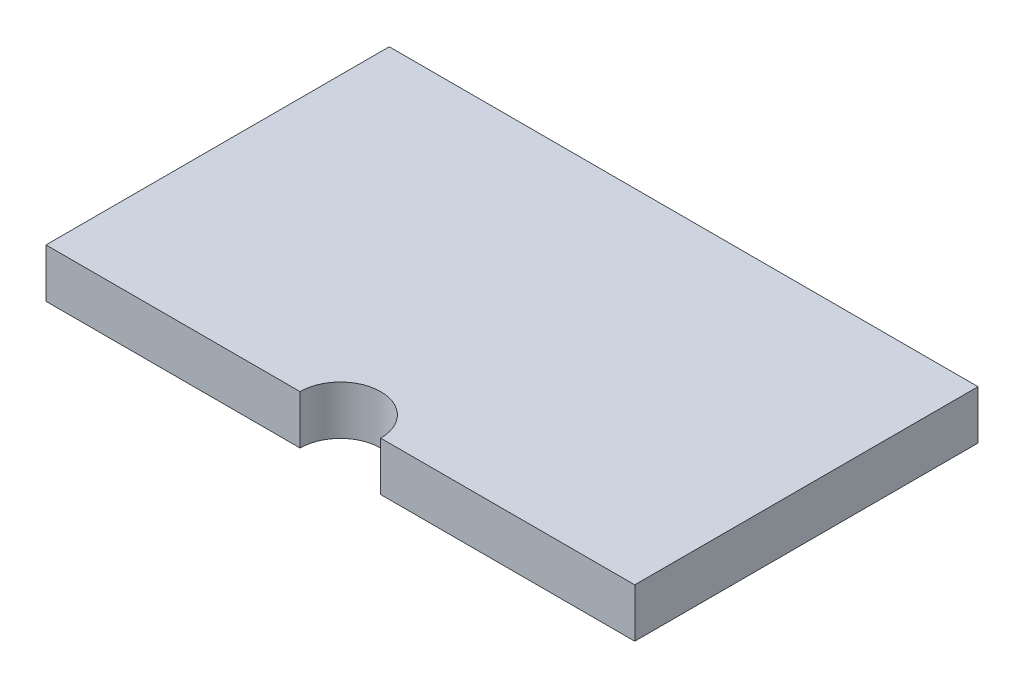
ISO-10303-21;
HEADER;
FILE_DESCRIPTION(('STEP AP214'),'2;1');
FILE_NAME('part.step','',(''),(''),'','','');
FILE_SCHEMA(('AUTOMOTIVE_DESIGN { 1 0 10303 214 1 1 1 1 }'));
ENDSEC;
DATA;
#1=APPLICATION_CONTEXT('core data for automotive mechanical design processes');
#2=APPLICATION_PROTOCOL_DEFINITION('international standard','automotive_design',2000,#1);
#3=PRODUCT_CONTEXT('',#1,'mechanical');
#4=PRODUCT('Part','Part','',(#3));
#5=PRODUCT_RELATED_PRODUCT_CATEGORY('part','',(#4));
#6=PRODUCT_DEFINITION_FORMATION('','',#4);
#7=PRODUCT_DEFINITION_CONTEXT('part definition',#1,'design');
#8=PRODUCT_DEFINITION('design','',#6,#7);
#9=PRODUCT_DEFINITION_SHAPE('','',#8);
#10=(LENGTH_UNIT() NAMED_UNIT(*) SI_UNIT(.MILLI.,.METRE.));
#11=(NAMED_UNIT(*) PLANE_ANGLE_UNIT() SI_UNIT($,.RADIAN.));
#12=(NAMED_UNIT(*) SI_UNIT($,.STERADIAN.) SOLID_ANGLE_UNIT());
#13=UNCERTAINTY_MEASURE_WITH_UNIT(LENGTH_MEASURE(1.E-05),#10,'distance_accuracy_value','');
#14=(GEOMETRIC_REPRESENTATION_CONTEXT(3) GLOBAL_UNCERTAINTY_ASSIGNED_CONTEXT((#13)) GLOBAL_UNIT_ASSIGNED_CONTEXT((#10,
#11,#12)) REPRESENTATION_CONTEXT('',''));
#15=CARTESIAN_POINT('',(0.,0.,0.));
#16=DIRECTION('',(0.,0.,1.));
#17=DIRECTION('',(1.,0.,0.));
#18=AXIS2_PLACEMENT_3D('',#15,#16,#17);
#19=CARTESIAN_POINT('',(-30.607,5.08,17.8435));
#20=DIRECTION('',(0.,0.,-1.));
#21=DIRECTION('',(-1.,0.,0.));
#22=AXIS2_PLACEMENT_3D('',#19,#20,#21);
#23=PLANE('',#22);
#24=DIRECTION('',(1.,0.,0.));
#25=VECTOR('',#24,1.);
#26=CARTESIAN_POINT('',(-30.607,0.,17.8435));
#27=LINE('',#26,#25);
#28=CARTESIAN_POINT('',(-30.607,0.,17.8435));
#29=VERTEX_POINT('',#28);
#30=CARTESIAN_POINT('',(-4.19099999999999,0.,17.8435));
#31=VERTEX_POINT('',#30);
#32=EDGE_CURVE('E117',#29,#31,#27,.T.);
#33=ORIENTED_EDGE('',*,*,#32,.T.);
#34=DIRECTION('',(0.,1.,0.));
#35=VECTOR('',#34,1.);
#36=CARTESIAN_POINT('',(-4.19099999999999,0.,17.8435));
#37=LINE('',#36,#35);
#38=CARTESIAN_POINT('',(-4.19099999999999,5.08,17.8435));
#39=VERTEX_POINT('',#38);
#40=EDGE_CURVE('E55',#31,#39,#37,.T.);
#41=ORIENTED_EDGE('',*,*,#40,.T.);
#42=DIRECTION('',(1.,0.,0.));
#43=VECTOR('',#42,1.);
#44=CARTESIAN_POINT('',(-30.607,5.08,17.8435));
#45=LINE('',#44,#43);
#46=CARTESIAN_POINT('',(-30.607,5.08,17.8435));
#47=VERTEX_POINT('',#46);
#48=EDGE_CURVE('E131',#47,#39,#45,.T.);
#49=ORIENTED_EDGE('',*,*,#48,.F.);
#50=DIRECTION('',(0.,-1.,0.));
#51=VECTOR('',#50,1.);
#52=CARTESIAN_POINT('',(-30.607,5.08,17.8435));
#53=LINE('',#52,#51);
#54=EDGE_CURVE('E130',#47,#29,#53,.T.);
#55=ORIENTED_EDGE('',*,*,#54,.T.);
#56=EDGE_LOOP('',(#33,#41,#49,#55));
#57=FACE_BOUND('',#56,.T.);
#58=ADVANCED_FACE('F39',(#57),#23,.F.);
#59=CARTESIAN_POINT('',(30.607,5.08,-17.8435));
#60=DIRECTION('',(-1.,0.,0.));
#61=DIRECTION('',(0.,0.,1.));
#62=AXIS2_PLACEMENT_3D('',#59,#60,#61);
#63=PLANE('',#62);
#64=DIRECTION('',(0.,0.,-1.));
#65=VECTOR('',#64,1.);
#66=CARTESIAN_POINT('',(30.607,0.,-17.8435));
#67=LINE('',#66,#65);
#68=CARTESIAN_POINT('',(30.607,0.,17.8435));
#69=VERTEX_POINT('',#68);
#70=CARTESIAN_POINT('',(30.607,0.,-17.8435));
#71=VERTEX_POINT('',#70);
#72=EDGE_CURVE('E115',#69,#71,#67,.T.);
#73=ORIENTED_EDGE('',*,*,#72,.T.);
#74=DIRECTION('',(0.,-1.,0.));
#75=VECTOR('',#74,1.);
#76=CARTESIAN_POINT('',(30.607,5.08,-17.8435));
#77=LINE('',#76,#75);
#78=CARTESIAN_POINT('',(30.607,5.08,-17.8435));
#79=VERTEX_POINT('',#78);
#80=EDGE_CURVE('E11',#79,#71,#77,.T.);
#81=ORIENTED_EDGE('',*,*,#80,.F.);
#82=DIRECTION('',(0.,0.,-1.));
#83=VECTOR('',#82,1.);
#84=CARTESIAN_POINT('',(30.607,5.08,-17.8435));
#85=LINE('',#84,#83);
#86=CARTESIAN_POINT('',(30.607,5.08,17.8435));
#87=VERTEX_POINT('',#86);
#88=EDGE_CURVE('E122',#87,#79,#85,.T.);
#89=ORIENTED_EDGE('',*,*,#88,.F.);
#90=DIRECTION('',(0.,-1.,0.));
#91=VECTOR('',#90,1.);
#92=CARTESIAN_POINT('',(30.607,5.08,17.8435));
#93=LINE('',#92,#91);
#94=EDGE_CURVE('E127',#87,#69,#93,.T.);
#95=ORIENTED_EDGE('',*,*,#94,.T.);
#96=EDGE_LOOP('',(#73,#81,#89,#95));
#97=FACE_BOUND('',#96,.T.);
#98=ADVANCED_FACE('F41',(#97),#63,.F.);
#99=CARTESIAN_POINT('',(-30.607,5.08,-17.8435));
#100=DIRECTION('',(0.,0.,1.));
#101=DIRECTION('',(1.,0.,0.));
#102=AXIS2_PLACEMENT_3D('',#99,#100,#101);
#103=PLANE('',#102);
#104=DIRECTION('',(-1.,0.,0.));
#105=VECTOR('',#104,1.);
#106=CARTESIAN_POINT('',(-30.607,0.,-17.8435));
#107=LINE('',#106,#105);
#108=CARTESIAN_POINT('',(-30.607,0.,-17.8435));
#109=VERTEX_POINT('',#108);
#110=EDGE_CURVE('E123',#71,#109,#107,.T.);
#111=ORIENTED_EDGE('',*,*,#110,.T.);
#112=DIRECTION('',(0.,-1.,0.));
#113=VECTOR('',#112,1.);
#114=CARTESIAN_POINT('',(-30.607,5.08,-17.8435));
#115=LINE('',#114,#113);
#116=CARTESIAN_POINT('',(-30.607,5.08,-17.8435));
#117=VERTEX_POINT('',#116);
#118=EDGE_CURVE('E48',#117,#109,#115,.T.);
#119=ORIENTED_EDGE('',*,*,#118,.F.);
#120=DIRECTION('',(-1.,0.,0.));
#121=VECTOR('',#120,1.);
#122=CARTESIAN_POINT('',(-30.607,5.08,-17.8435));
#123=LINE('',#122,#121);
#124=EDGE_CURVE('E93',#79,#117,#123,.T.);
#125=ORIENTED_EDGE('',*,*,#124,.F.);
#126=ORIENTED_EDGE('',*,*,#80,.T.);
#127=EDGE_LOOP('',(#111,#119,#125,#126));
#128=FACE_BOUND('',#127,.T.);
#129=ADVANCED_FACE('F153',(#128),#103,.F.);
#130=CARTESIAN_POINT('',(-30.607,5.08,-17.8435));
#131=DIRECTION('',(1.,0.,0.));
#132=DIRECTION('',(0.,0.,-1.));
#133=AXIS2_PLACEMENT_3D('',#130,#131,#132);
#134=PLANE('',#133);
#135=DIRECTION('',(0.,0.,1.));
#136=VECTOR('',#135,1.);
#137=CARTESIAN_POINT('',(-30.607,0.,-17.8435));
#138=LINE('',#137,#136);
#139=EDGE_CURVE('E118',#109,#29,#138,.T.);
#140=ORIENTED_EDGE('',*,*,#139,.T.);
#141=ORIENTED_EDGE('',*,*,#54,.F.);
#142=DIRECTION('',(0.,0.,1.));
#143=VECTOR('',#142,1.);
#144=CARTESIAN_POINT('',(-30.607,5.08,-17.8435));
#145=LINE('',#144,#143);
#146=EDGE_CURVE('E141',#117,#47,#145,.T.);
#147=ORIENTED_EDGE('',*,*,#146,.F.);
#148=ORIENTED_EDGE('',*,*,#118,.T.);
#149=EDGE_LOOP('',(#140,#141,#147,#148));
#150=FACE_BOUND('',#149,.T.);
#151=ADVANCED_FACE('F139',(#150),#134,.F.);
#152=CARTESIAN_POINT('',(4.19100000000001,5.08,17.8435));
#153=VERTEX_POINT('',#152);
#154=EDGE_CURVE('E64',#153,#87,#45,.T.);
#155=ORIENTED_EDGE('',*,*,#154,.F.);
#156=DIRECTION('',(0.,1.,0.));
#157=VECTOR('',#156,1.);
#158=CARTESIAN_POINT('',(4.19100000000001,0.,17.8435));
#159=LINE('',#158,#157);
#160=CARTESIAN_POINT('',(4.19100000000001,0.,17.8435));
#161=VERTEX_POINT('',#160);
#162=EDGE_CURVE('E102',#153,#161,#159,.F.);
#163=ORIENTED_EDGE('',*,*,#162,.T.);
#164=EDGE_CURVE('E86',#161,#69,#27,.T.);
#165=ORIENTED_EDGE('',*,*,#164,.T.);
#166=ORIENTED_EDGE('',*,*,#94,.F.);
#167=EDGE_LOOP('',(#155,#163,#165,#166));
#168=FACE_BOUND('',#167,.T.);
#169=ADVANCED_FACE('F109',(#168),#23,.F.);
#170=CARTESIAN_POINT('',(0.,5.08,0.));
#171=DIRECTION('',(0.,1.,0.));
#172=DIRECTION('',(0.,0.,1.));
#173=AXIS2_PLACEMENT_3D('',#170,#171,#172);
#174=PLANE('',#173);
#175=CARTESIAN_POINT('',(0.,5.08,17.8435));
#176=DIRECTION('',(0.,1.,0.));
#177=DIRECTION('',(0.,0.,1.));
#178=AXIS2_PLACEMENT_3D('',#175,#176,#177);
#179=CIRCLE('',#178,4.191);
#180=EDGE_CURVE('E107',#153,#39,#179,.T.);
#181=ORIENTED_EDGE('',*,*,#180,.F.);
#182=ORIENTED_EDGE('',*,*,#154,.T.);
#183=ORIENTED_EDGE('',*,*,#88,.T.);
#184=ORIENTED_EDGE('',*,*,#124,.T.);
#185=ORIENTED_EDGE('',*,*,#146,.T.);
#186=ORIENTED_EDGE('',*,*,#48,.T.);
#187=EDGE_LOOP('',(#181,#182,#183,#184,#185,#186));
#188=FACE_BOUND('',#187,.T.);
#189=ADVANCED_FACE('F164',(#188),#174,.T.);
#190=CARTESIAN_POINT('',(0.,0.,0.));
#191=DIRECTION('',(0.,1.,0.));
#192=DIRECTION('',(0.,0.,1.));
#193=AXIS2_PLACEMENT_3D('',#190,#191,#192);
#194=PLANE('',#193);
#195=ORIENTED_EDGE('',*,*,#164,.F.);
#196=CARTESIAN_POINT('',(0.,0.,17.8435));
#197=DIRECTION('',(0.,1.,0.));
#198=DIRECTION('',(0.,0.,1.));
#199=AXIS2_PLACEMENT_3D('',#196,#197,#198);
#200=CIRCLE('',#199,4.191);
#201=EDGE_CURVE('E100',#161,#31,#200,.T.);
#202=ORIENTED_EDGE('',*,*,#201,.T.);
#203=ORIENTED_EDGE('',*,*,#32,.F.);
#204=ORIENTED_EDGE('',*,*,#139,.F.);
#205=ORIENTED_EDGE('',*,*,#110,.F.);
#206=ORIENTED_EDGE('',*,*,#72,.F.);
#207=EDGE_LOOP('',(#195,#202,#203,#204,#205,#206));
#208=FACE_BOUND('',#207,.T.);
#209=ADVANCED_FACE('F113',(#208),#194,.F.);
#210=CARTESIAN_POINT('',(0.,0.,17.8435));
#211=DIRECTION('',(0.,1.,0.));
#212=DIRECTION('',(0.,0.,1.));
#213=AXIS2_PLACEMENT_3D('',#210,#211,#212);
#214=CYLINDRICAL_SURFACE('',#213,4.191);
#215=ORIENTED_EDGE('',*,*,#201,.F.);
#216=ORIENTED_EDGE('',*,*,#162,.F.);
#217=ORIENTED_EDGE('',*,*,#180,.T.);
#218=ORIENTED_EDGE('',*,*,#40,.F.);
#219=EDGE_LOOP('',(#215,#216,#217,#218));
#220=FACE_BOUND('',#219,.T.);
#221=ADVANCED_FACE('F101',(#220),#214,.F.);
#222=CLOSED_SHELL('',(#58,#98,#129,#151,#169,#189,#209,#221));
#223=MANIFOLD_SOLID_BREP('B2',#222);
#224=ADVANCED_BREP_SHAPE_REPRESENTATION('',(#18,#223),#14);
#225=SHAPE_DEFINITION_REPRESENTATION(#9,#224);
ENDSEC;
END-ISO-10303-21;
